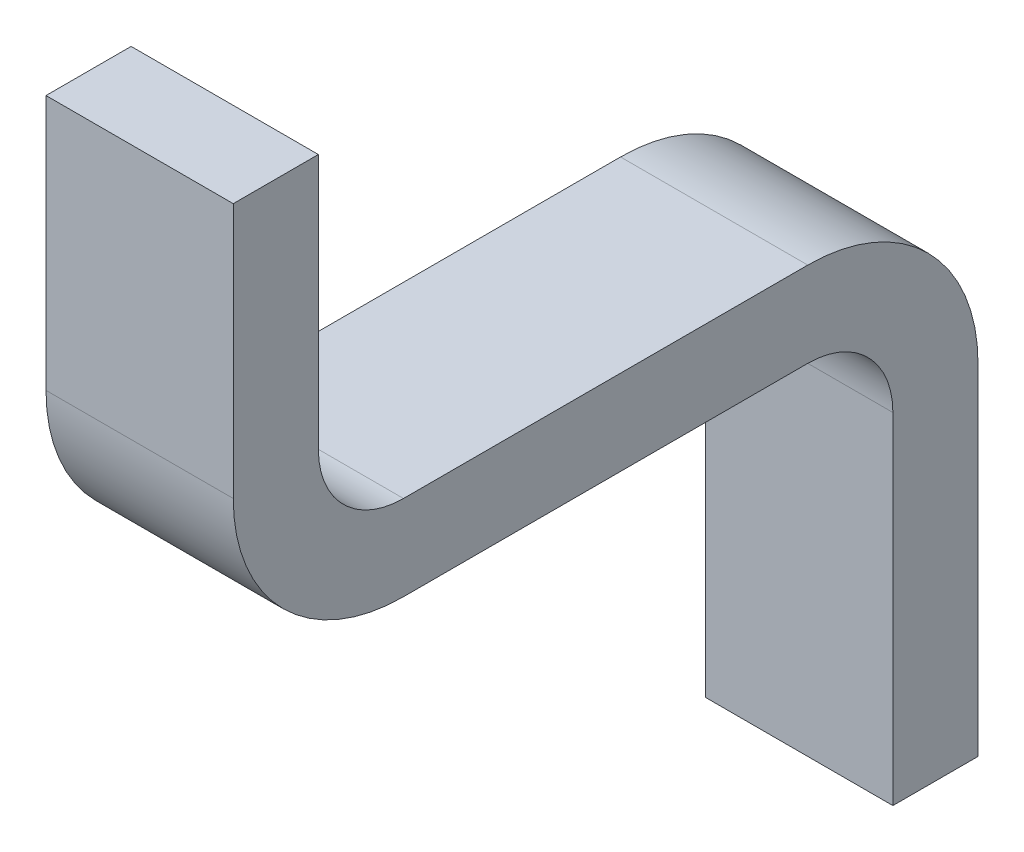
ISO-10303-21;
HEADER;
FILE_DESCRIPTION(('STEP AP214'),'2;1');
FILE_NAME('part.step','',(''),(''),'','','');
FILE_SCHEMA(('AUTOMOTIVE_DESIGN { 1 0 10303 214 1 1 1 1 }'));
ENDSEC;
DATA;
#1=APPLICATION_CONTEXT('core data for automotive mechanical design processes');
#2=APPLICATION_PROTOCOL_DEFINITION('international standard','automotive_design',2000,#1);
#3=PRODUCT_CONTEXT('',#1,'mechanical');
#4=PRODUCT('Part','Part','',(#3));
#5=PRODUCT_RELATED_PRODUCT_CATEGORY('part','',(#4));
#6=PRODUCT_DEFINITION_FORMATION('','',#4);
#7=PRODUCT_DEFINITION_CONTEXT('part definition',#1,'design');
#8=PRODUCT_DEFINITION('design','',#6,#7);
#9=PRODUCT_DEFINITION_SHAPE('','',#8);
#10=(LENGTH_UNIT() NAMED_UNIT(*) SI_UNIT(.MILLI.,.METRE.));
#11=(NAMED_UNIT(*) PLANE_ANGLE_UNIT() SI_UNIT($,.RADIAN.));
#12=(NAMED_UNIT(*) SI_UNIT($,.STERADIAN.) SOLID_ANGLE_UNIT());
#13=UNCERTAINTY_MEASURE_WITH_UNIT(LENGTH_MEASURE(1.E-05),#10,'distance_accuracy_value','');
#14=(GEOMETRIC_REPRESENTATION_CONTEXT(3) GLOBAL_UNCERTAINTY_ASSIGNED_CONTEXT((#13)) GLOBAL_UNIT_ASSIGNED_CONTEXT((#10,
#11,#12)) REPRESENTATION_CONTEXT('',''));
#15=CARTESIAN_POINT('',(0.,0.,0.));
#16=DIRECTION('',(0.,0.,1.));
#17=DIRECTION('',(1.,0.,0.));
#18=AXIS2_PLACEMENT_3D('',#15,#16,#17);
#19=CARTESIAN_POINT('',(-1.86,-4.,0.675));
#20=DIRECTION('',(1.,0.,0.));
#21=DIRECTION('',(0.,1.,0.));
#22=AXIS2_PLACEMENT_3D('',#19,#20,#21);
#23=PLANE('',#22);
#24=CARTESIAN_POINT('',(-1.86,-3.8,0.675));
#25=DIRECTION('',(-1.,0.,0.));
#26=DIRECTION('',(0.,-1.,0.));
#27=AXIS2_PLACEMENT_3D('',#24,#25,#26);
#28=CIRCLE('',#27,0.2);
#29=CARTESIAN_POINT('',(-1.86,-3.8,0.875));
#30=VERTEX_POINT('',#29);
#31=CARTESIAN_POINT('',(-1.86,-4.,0.675));
#32=VERTEX_POINT('',#31);
#33=EDGE_CURVE('E150',#30,#32,#28,.F.);
#34=ORIENTED_EDGE('',*,*,#33,.F.);
#35=DIRECTION('',(0.,1.,0.));
#36=VECTOR('',#35,1.);
#37=CARTESIAN_POINT('',(-1.86,-3.50000000000001,0.875));
#38=LINE('',#37,#36);
#39=CARTESIAN_POINT('',(-1.86,-3.50000000000001,0.875));
#40=VERTEX_POINT('',#39);
#41=EDGE_CURVE('E147',#30,#40,#38,.T.);
#42=ORIENTED_EDGE('',*,*,#41,.T.);
#43=DIRECTION('',(0.,0.,1.));
#44=VECTOR('',#43,1.);
#45=CARTESIAN_POINT('',(-1.86,-3.50000000000001,0.775));
#46=LINE('',#45,#44);
#47=CARTESIAN_POINT('',(-1.86,-3.50000000000001,0.775));
#48=VERTEX_POINT('',#47);
#49=EDGE_CURVE('E141',#48,#40,#46,.T.);
#50=ORIENTED_EDGE('',*,*,#49,.F.);
#51=DIRECTION('',(0.,1.,0.));
#52=VECTOR('',#51,1.);
#53=CARTESIAN_POINT('',(-1.86,-3.50000000000001,0.775));
#54=LINE('',#53,#52);
#55=CARTESIAN_POINT('',(-1.86,-3.8,0.775));
#56=VERTEX_POINT('',#55);
#57=EDGE_CURVE('E115',#48,#56,#54,.F.);
#58=ORIENTED_EDGE('',*,*,#57,.T.);
#59=CARTESIAN_POINT('',(-1.86,-3.8,0.675));
#60=DIRECTION('',(-1.,0.,0.));
#61=DIRECTION('',(0.,-1.,0.));
#62=AXIS2_PLACEMENT_3D('',#59,#60,#61);
#63=CIRCLE('',#62,0.1);
#64=CARTESIAN_POINT('',(-1.86,-3.9,0.675));
#65=VERTEX_POINT('',#64);
#66=EDGE_CURVE('E215',#56,#65,#63,.F.);
#67=ORIENTED_EDGE('',*,*,#66,.T.);
#68=DIRECTION('',(0.,0.,1.));
#69=VECTOR('',#68,1.);
#70=CARTESIAN_POINT('',(-1.86,-3.9,0.675));
#71=LINE('',#70,#69);
#72=CARTESIAN_POINT('',(-1.86,-3.9,0.2));
#73=VERTEX_POINT('',#72);
#74=EDGE_CURVE('E181',#65,#73,#71,.F.);
#75=ORIENTED_EDGE('',*,*,#74,.T.);
#76=CARTESIAN_POINT('',(-1.86,-4.1,0.2));
#77=DIRECTION('',(1.,0.,0.));
#78=DIRECTION('',(0.,1.,0.));
#79=AXIS2_PLACEMENT_3D('',#76,#77,#78);
#80=CIRCLE('',#79,0.2);
#81=CARTESIAN_POINT('',(-1.86,-4.1,0.));
#82=VERTEX_POINT('',#81);
#83=EDGE_CURVE('E20',#82,#73,#80,.T.);
#84=ORIENTED_EDGE('',*,*,#83,.F.);
#85=DIRECTION('',(0.,1.,0.));
#86=VECTOR('',#85,1.);
#87=CARTESIAN_POINT('',(-1.86,-4.1,0.));
#88=LINE('',#87,#86);
#89=CARTESIAN_POINT('',(-1.86,-4.5,0.));
#90=VERTEX_POINT('',#89);
#91=EDGE_CURVE('E91',#82,#90,#88,.F.);
#92=ORIENTED_EDGE('',*,*,#91,.T.);
#93=DIRECTION('',(0.,0.,1.));
#94=VECTOR('',#93,1.);
#95=CARTESIAN_POINT('',(-1.86,-4.5,0.));
#96=LINE('',#95,#94);
#97=CARTESIAN_POINT('',(-1.86,-4.5,0.1));
#98=VERTEX_POINT('',#97);
#99=EDGE_CURVE('E163',#90,#98,#96,.T.);
#100=ORIENTED_EDGE('',*,*,#99,.T.);
#101=DIRECTION('',(0.,1.,0.));
#102=VECTOR('',#101,1.);
#103=CARTESIAN_POINT('',(-1.86,-4.1,0.1));
#104=LINE('',#103,#102);
#105=CARTESIAN_POINT('',(-1.86,-4.1,0.1));
#106=VERTEX_POINT('',#105);
#107=EDGE_CURVE('E159',#98,#106,#104,.T.);
#108=ORIENTED_EDGE('',*,*,#107,.T.);
#109=CARTESIAN_POINT('',(-1.86,-4.1,0.2));
#110=DIRECTION('',(1.,0.,0.));
#111=DIRECTION('',(0.,1.,0.));
#112=AXIS2_PLACEMENT_3D('',#109,#110,#111);
#113=CIRCLE('',#112,0.1);
#114=CARTESIAN_POINT('',(-1.86,-4.,0.2));
#115=VERTEX_POINT('',#114);
#116=EDGE_CURVE('E155',#106,#115,#113,.T.);
#117=ORIENTED_EDGE('',*,*,#116,.T.);
#118=DIRECTION('',(0.,0.,1.));
#119=VECTOR('',#118,1.);
#120=CARTESIAN_POINT('',(-1.86,-4.,0.675));
#121=LINE('',#120,#119);
#122=EDGE_CURVE('E154',#115,#32,#121,.T.);
#123=ORIENTED_EDGE('',*,*,#122,.T.);
#124=EDGE_LOOP('',(#34,#42,#50,#58,#67,#75,#84,#92,#100,#108,#117,#123));
#125=FACE_BOUND('',#124,.T.);
#126=ADVANCED_FACE('F17',(#125),#23,.F.);
#127=CARTESIAN_POINT('',(-1.86,-4.1,0.2));
#128=DIRECTION('',(1.,0.,0.));
#129=DIRECTION('',(0.,1.,0.));
#130=AXIS2_PLACEMENT_3D('',#127,#128,#129);
#131=CYLINDRICAL_SURFACE('',#130,0.2);
#132=CARTESIAN_POINT('',(-1.64,-4.1,0.2));
#133=DIRECTION('',(1.,0.,0.));
#134=DIRECTION('',(0.,1.,0.));
#135=AXIS2_PLACEMENT_3D('',#132,#133,#134);
#136=CIRCLE('',#135,0.2);
#137=CARTESIAN_POINT('',(-1.64,-3.90000000000001,0.2));
#138=VERTEX_POINT('',#137);
#139=CARTESIAN_POINT('',(-1.64,-4.1,0.));
#140=VERTEX_POINT('',#139);
#141=EDGE_CURVE('E183',#138,#140,#136,.F.);
#142=ORIENTED_EDGE('',*,*,#141,.T.);
#143=DIRECTION('',(1.,0.,0.));
#144=VECTOR('',#143,1.);
#145=CARTESIAN_POINT('',(-1.86,-4.1,0.));
#146=LINE('',#145,#144);
#147=EDGE_CURVE('E178',#140,#82,#146,.F.);
#148=ORIENTED_EDGE('',*,*,#147,.T.);
#149=ORIENTED_EDGE('',*,*,#83,.T.);
#150=DIRECTION('',(1.,0.,0.));
#151=VECTOR('',#150,1.);
#152=CARTESIAN_POINT('',(-1.86,-3.9,0.2));
#153=LINE('',#152,#151);
#154=EDGE_CURVE('E217',#73,#138,#153,.T.);
#155=ORIENTED_EDGE('',*,*,#154,.T.);
#156=EDGE_LOOP('',(#142,#148,#149,#155));
#157=FACE_BOUND('',#156,.T.);
#158=ADVANCED_FACE('F254',(#157),#131,.T.);
#159=CARTESIAN_POINT('',(-1.86,-4.1,0.));
#160=DIRECTION('',(0.,0.,1.));
#161=DIRECTION('',(1.,0.,0.));
#162=AXIS2_PLACEMENT_3D('',#159,#160,#161);
#163=PLANE('',#162);
#164=ORIENTED_EDGE('',*,*,#147,.F.);
#165=DIRECTION('',(0.,-1.,0.));
#166=VECTOR('',#165,1.);
#167=CARTESIAN_POINT('',(-1.64,-3.90000000000001,0.));
#168=LINE('',#167,#166);
#169=CARTESIAN_POINT('',(-1.64,-4.5,0.));
#170=VERTEX_POINT('',#169);
#171=EDGE_CURVE('E170',#140,#170,#168,.T.);
#172=ORIENTED_EDGE('',*,*,#171,.T.);
#173=DIRECTION('',(-1.,0.,0.));
#174=VECTOR('',#173,1.);
#175=CARTESIAN_POINT('',(-1.86,-4.5,0.));
#176=LINE('',#175,#174);
#177=EDGE_CURVE('E173',#170,#90,#176,.T.);
#178=ORIENTED_EDGE('',*,*,#177,.T.);
#179=ORIENTED_EDGE('',*,*,#91,.F.);
#180=EDGE_LOOP('',(#164,#172,#178,#179));
#181=FACE_BOUND('',#180,.T.);
#182=ADVANCED_FACE('F257',(#181),#163,.F.);
#183=CARTESIAN_POINT('',(-1.86,-4.5,0.));
#184=DIRECTION('',(0.,1.,0.));
#185=DIRECTION('',(-1.,0.,0.));
#186=AXIS2_PLACEMENT_3D('',#183,#184,#185);
#187=PLANE('',#186);
#188=DIRECTION('',(-1.,0.,0.));
#189=VECTOR('',#188,1.);
#190=CARTESIAN_POINT('',(-1.64,-4.5,0.1));
#191=LINE('',#190,#189);
#192=CARTESIAN_POINT('',(-1.64,-4.5,0.1));
#193=VERTEX_POINT('',#192);
#194=EDGE_CURVE('E160',#193,#98,#191,.T.);
#195=ORIENTED_EDGE('',*,*,#194,.T.);
#196=ORIENTED_EDGE('',*,*,#99,.F.);
#197=ORIENTED_EDGE('',*,*,#177,.F.);
#198=DIRECTION('',(0.,0.,1.));
#199=VECTOR('',#198,1.);
#200=CARTESIAN_POINT('',(-1.64,-4.5,0.675));
#201=LINE('',#200,#199);
#202=EDGE_CURVE('E166',#170,#193,#201,.T.);
#203=ORIENTED_EDGE('',*,*,#202,.T.);
#204=EDGE_LOOP('',(#195,#196,#197,#203));
#205=FACE_BOUND('',#204,.T.);
#206=ADVANCED_FACE('F259',(#205),#187,.F.);
#207=CARTESIAN_POINT('',(-1.64,-4.1,0.1));
#208=DIRECTION('',(0.,0.,-1.));
#209=DIRECTION('',(-1.,0.,0.));
#210=AXIS2_PLACEMENT_3D('',#207,#208,#209);
#211=PLANE('',#210);
#212=DIRECTION('',(1.,0.,0.));
#213=VECTOR('',#212,1.);
#214=CARTESIAN_POINT('',(-1.64,-4.1,0.1));
#215=LINE('',#214,#213);
#216=CARTESIAN_POINT('',(-1.64,-4.1,0.1));
#217=VERTEX_POINT('',#216);
#218=EDGE_CURVE('E156',#217,#106,#215,.F.);
#219=ORIENTED_EDGE('',*,*,#218,.T.);
#220=ORIENTED_EDGE('',*,*,#107,.F.);
#221=ORIENTED_EDGE('',*,*,#194,.F.);
#222=DIRECTION('',(0.,-1.,0.));
#223=VECTOR('',#222,1.);
#224=CARTESIAN_POINT('',(-1.64,-3.90000000000001,0.1));
#225=LINE('',#224,#223);
#226=EDGE_CURVE('E169',#193,#217,#225,.F.);
#227=ORIENTED_EDGE('',*,*,#226,.T.);
#228=EDGE_LOOP('',(#219,#220,#221,#227));
#229=FACE_BOUND('',#228,.T.);
#230=ADVANCED_FACE('F234',(#229),#211,.F.);
#231=CARTESIAN_POINT('',(-1.64,-4.1,0.2));
#232=DIRECTION('',(1.,0.,0.));
#233=DIRECTION('',(0.,1.,0.));
#234=AXIS2_PLACEMENT_3D('',#231,#232,#233);
#235=CYLINDRICAL_SURFACE('',#234,0.1);
#236=DIRECTION('',(-1.,0.,0.));
#237=VECTOR('',#236,1.);
#238=CARTESIAN_POINT('',(-1.64,-4.,0.2));
#239=LINE('',#238,#237);
#240=CARTESIAN_POINT('',(-1.64,-4.,0.2));
#241=VERTEX_POINT('',#240);
#242=EDGE_CURVE('E151',#241,#115,#239,.T.);
#243=ORIENTED_EDGE('',*,*,#242,.T.);
#244=ORIENTED_EDGE('',*,*,#116,.F.);
#245=ORIENTED_EDGE('',*,*,#218,.F.);
#246=CARTESIAN_POINT('',(-1.64,-4.1,0.2));
#247=DIRECTION('',(1.,0.,0.));
#248=DIRECTION('',(0.,1.,0.));
#249=AXIS2_PLACEMENT_3D('',#246,#247,#248);
#250=CIRCLE('',#249,0.1);
#251=EDGE_CURVE('E210',#217,#241,#250,.T.);
#252=ORIENTED_EDGE('',*,*,#251,.T.);
#253=EDGE_LOOP('',(#243,#244,#245,#252));
#254=FACE_BOUND('',#253,.T.);
#255=ADVANCED_FACE('F227',(#254),#235,.F.);
#256=CARTESIAN_POINT('',(-1.64,-4.,0.675));
#257=DIRECTION('',(0.,1.,0.));
#258=DIRECTION('',(-1.,0.,0.));
#259=AXIS2_PLACEMENT_3D('',#256,#257,#258);
#260=PLANE('',#259);
#261=DIRECTION('',(-1.,0.,0.));
#262=VECTOR('',#261,1.);
#263=CARTESIAN_POINT('',(-1.64,-4.,0.675));
#264=LINE('',#263,#262);
#265=CARTESIAN_POINT('',(-1.64,-4.,0.675));
#266=VERTEX_POINT('',#265);
#267=EDGE_CURVE('E148',#32,#266,#264,.F.);
#268=ORIENTED_EDGE('',*,*,#267,.F.);
#269=ORIENTED_EDGE('',*,*,#122,.F.);
#270=ORIENTED_EDGE('',*,*,#242,.F.);
#271=DIRECTION('',(0.,0.,1.));
#272=VECTOR('',#271,1.);
#273=CARTESIAN_POINT('',(-1.64,-4.,0.675));
#274=LINE('',#273,#272);
#275=EDGE_CURVE('E209',#241,#266,#274,.T.);
#276=ORIENTED_EDGE('',*,*,#275,.T.);
#277=EDGE_LOOP('',(#268,#269,#270,#276));
#278=FACE_BOUND('',#277,.T.);
#279=ADVANCED_FACE('F224',(#278),#260,.F.);
#280=CARTESIAN_POINT('',(-1.64,-3.8,0.675));
#281=DIRECTION('',(-1.,0.,0.));
#282=DIRECTION('',(0.,-1.,0.));
#283=AXIS2_PLACEMENT_3D('',#280,#281,#282);
#284=CYLINDRICAL_SURFACE('',#283,0.2);
#285=ORIENTED_EDGE('',*,*,#33,.T.);
#286=ORIENTED_EDGE('',*,*,#267,.T.);
#287=CARTESIAN_POINT('',(-1.64,-3.8,0.675));
#288=DIRECTION('',(-1.,0.,0.));
#289=DIRECTION('',(0.,-1.,0.));
#290=AXIS2_PLACEMENT_3D('',#287,#288,#289);
#291=CIRCLE('',#290,0.2);
#292=CARTESIAN_POINT('',(-1.64,-3.8,0.875));
#293=VERTEX_POINT('',#292);
#294=EDGE_CURVE('E133',#266,#293,#291,.T.);
#295=ORIENTED_EDGE('',*,*,#294,.T.);
#296=DIRECTION('',(-1.,0.,0.));
#297=VECTOR('',#296,1.);
#298=CARTESIAN_POINT('',(-1.64,-3.8,0.875));
#299=LINE('',#298,#297);
#300=EDGE_CURVE('E144',#293,#30,#299,.T.);
#301=ORIENTED_EDGE('',*,*,#300,.T.);
#302=EDGE_LOOP('',(#285,#286,#295,#301));
#303=FACE_BOUND('',#302,.T.);
#304=ADVANCED_FACE('F285',(#303),#284,.T.);
#305=CARTESIAN_POINT('',(-1.64,-3.50000000000001,0.875));
#306=DIRECTION('',(0.,0.,-1.));
#307=DIRECTION('',(-1.,0.,0.));
#308=AXIS2_PLACEMENT_3D('',#305,#306,#307);
#309=PLANE('',#308);
#310=DIRECTION('',(-1.,0.,0.));
#311=VECTOR('',#310,1.);
#312=CARTESIAN_POINT('',(-1.86,-3.50000000000001,0.875));
#313=LINE('',#312,#311);
#314=CARTESIAN_POINT('',(-1.64,-3.50000000000001,0.875));
#315=VERTEX_POINT('',#314);
#316=EDGE_CURVE('E118',#40,#315,#313,.F.);
#317=ORIENTED_EDGE('',*,*,#316,.F.);
#318=ORIENTED_EDGE('',*,*,#41,.F.);
#319=ORIENTED_EDGE('',*,*,#300,.F.);
#320=DIRECTION('',(0.,-1.,0.));
#321=VECTOR('',#320,1.);
#322=CARTESIAN_POINT('',(-1.64,-3.90000000000001,0.875));
#323=LINE('',#322,#321);
#324=EDGE_CURVE('E131',#293,#315,#323,.F.);
#325=ORIENTED_EDGE('',*,*,#324,.T.);
#326=EDGE_LOOP('',(#317,#318,#319,#325));
#327=FACE_BOUND('',#326,.T.);
#328=ADVANCED_FACE('F282',(#327),#309,.F.);
#329=CARTESIAN_POINT('',(-1.86,-3.50000000000001,0.775));
#330=DIRECTION('',(0.,1.,0.));
#331=DIRECTION('',(-1.,0.,0.));
#332=AXIS2_PLACEMENT_3D('',#329,#330,#331);
#333=PLANE('',#332);
#334=ORIENTED_EDGE('',*,*,#49,.T.);
#335=ORIENTED_EDGE('',*,*,#316,.T.);
#336=DIRECTION('',(0.,0.,1.));
#337=VECTOR('',#336,1.);
#338=CARTESIAN_POINT('',(-1.64,-3.50000000000001,0.675));
#339=LINE('',#338,#337);
#340=CARTESIAN_POINT('',(-1.64,-3.50000000000001,0.775));
#341=VERTEX_POINT('',#340);
#342=EDGE_CURVE('E125',#315,#341,#339,.F.);
#343=ORIENTED_EDGE('',*,*,#342,.T.);
#344=DIRECTION('',(1.,0.,0.));
#345=VECTOR('',#344,1.);
#346=CARTESIAN_POINT('',(-1.86,-3.50000000000001,0.775));
#347=LINE('',#346,#345);
#348=EDGE_CURVE('E110',#341,#48,#347,.F.);
#349=ORIENTED_EDGE('',*,*,#348,.T.);
#350=EDGE_LOOP('',(#334,#335,#343,#349));
#351=FACE_BOUND('',#350,.T.);
#352=ADVANCED_FACE('F129',(#351),#333,.T.);
#353=CARTESIAN_POINT('',(-1.86,-3.50000000000001,0.775));
#354=DIRECTION('',(0.,0.,1.));
#355=DIRECTION('',(1.,0.,0.));
#356=AXIS2_PLACEMENT_3D('',#353,#354,#355);
#357=PLANE('',#356);
#358=ORIENTED_EDGE('',*,*,#348,.F.);
#359=DIRECTION('',(0.,-1.,0.));
#360=VECTOR('',#359,1.);
#361=CARTESIAN_POINT('',(-1.64,-3.90000000000001,0.775));
#362=LINE('',#361,#360);
#363=CARTESIAN_POINT('',(-1.64,-3.8,0.775));
#364=VERTEX_POINT('',#363);
#365=EDGE_CURVE('E114',#341,#364,#362,.T.);
#366=ORIENTED_EDGE('',*,*,#365,.T.);
#367=DIRECTION('',(-1.,0.,0.));
#368=VECTOR('',#367,1.);
#369=CARTESIAN_POINT('',(-1.86,-3.8,0.775));
#370=LINE('',#369,#368);
#371=EDGE_CURVE('E185',#364,#56,#370,.T.);
#372=ORIENTED_EDGE('',*,*,#371,.T.);
#373=ORIENTED_EDGE('',*,*,#57,.F.);
#374=EDGE_LOOP('',(#358,#366,#372,#373));
#375=FACE_BOUND('',#374,.T.);
#376=ADVANCED_FACE('F112',(#375),#357,.F.);
#377=CARTESIAN_POINT('',(-1.86,-3.8,0.675));
#378=DIRECTION('',(-1.,0.,0.));
#379=DIRECTION('',(0.,-1.,0.));
#380=AXIS2_PLACEMENT_3D('',#377,#378,#379);
#381=CYLINDRICAL_SURFACE('',#380,0.1);
#382=ORIENTED_EDGE('',*,*,#371,.F.);
#383=CARTESIAN_POINT('',(-1.64,-3.8,0.675));
#384=DIRECTION('',(-1.,0.,0.));
#385=DIRECTION('',(0.,-1.,0.));
#386=AXIS2_PLACEMENT_3D('',#383,#384,#385);
#387=CIRCLE('',#386,0.1);
#388=CARTESIAN_POINT('',(-1.64,-3.90000000000001,0.675));
#389=VERTEX_POINT('',#388);
#390=EDGE_CURVE('E26',#364,#389,#387,.F.);
#391=ORIENTED_EDGE('',*,*,#390,.T.);
#392=DIRECTION('',(1.,0.,0.));
#393=VECTOR('',#392,1.);
#394=CARTESIAN_POINT('',(-1.86,-3.9,0.675));
#395=LINE('',#394,#393);
#396=EDGE_CURVE('E34',#389,#65,#395,.F.);
#397=ORIENTED_EDGE('',*,*,#396,.T.);
#398=ORIENTED_EDGE('',*,*,#66,.F.);
#399=EDGE_LOOP('',(#382,#391,#397,#398));
#400=FACE_BOUND('',#399,.T.);
#401=ADVANCED_FACE('F250',(#400),#381,.F.);
#402=CARTESIAN_POINT('',(-1.86,-3.9,0.675));
#403=DIRECTION('',(0.,-1.,0.));
#404=DIRECTION('',(1.,0.,0.));
#405=AXIS2_PLACEMENT_3D('',#402,#403,#404);
#406=PLANE('',#405);
#407=ORIENTED_EDGE('',*,*,#396,.F.);
#408=DIRECTION('',(0.,0.,1.));
#409=VECTOR('',#408,1.);
#410=CARTESIAN_POINT('',(-1.64,-3.90000000000001,0.675));
#411=LINE('',#410,#409);
#412=EDGE_CURVE('E11',#389,#138,#411,.F.);
#413=ORIENTED_EDGE('',*,*,#412,.T.);
#414=ORIENTED_EDGE('',*,*,#154,.F.);
#415=ORIENTED_EDGE('',*,*,#74,.F.);
#416=EDGE_LOOP('',(#407,#413,#414,#415));
#417=FACE_BOUND('',#416,.T.);
#418=ADVANCED_FACE('F252',(#417),#406,.F.);
#419=CARTESIAN_POINT('',(-1.64,-3.90000000000001,0.675));
#420=DIRECTION('',(-1.,0.,0.));
#421=DIRECTION('',(0.,-1.,0.));
#422=AXIS2_PLACEMENT_3D('',#419,#420,#421);
#423=PLANE('',#422);
#424=ORIENTED_EDGE('',*,*,#390,.F.);
#425=ORIENTED_EDGE('',*,*,#365,.F.);
#426=ORIENTED_EDGE('',*,*,#342,.F.);
#427=ORIENTED_EDGE('',*,*,#324,.F.);
#428=ORIENTED_EDGE('',*,*,#294,.F.);
#429=ORIENTED_EDGE('',*,*,#275,.F.);
#430=ORIENTED_EDGE('',*,*,#251,.F.);
#431=ORIENTED_EDGE('',*,*,#226,.F.);
#432=ORIENTED_EDGE('',*,*,#202,.F.);
#433=ORIENTED_EDGE('',*,*,#171,.F.);
#434=ORIENTED_EDGE('',*,*,#141,.F.);
#435=ORIENTED_EDGE('',*,*,#412,.F.);
#436=EDGE_LOOP('',(#424,#425,#426,#427,#428,#429,#430,#431,#432,#433,#434,#435));
#437=FACE_BOUND('',#436,.T.);
#438=ADVANCED_FACE('F123',(#437),#423,.F.);
#439=CLOSED_SHELL('',(#126,#158,#182,#206,#230,#255,#279,#304,#328,#352,#376,#401,#418,#438));
#440=MANIFOLD_SOLID_BREP('B1',#439);
#441=ADVANCED_BREP_SHAPE_REPRESENTATION('',(#18,#440),#14);
#442=SHAPE_DEFINITION_REPRESENTATION(#9,#441);
ENDSEC;
END-ISO-10303-21;
